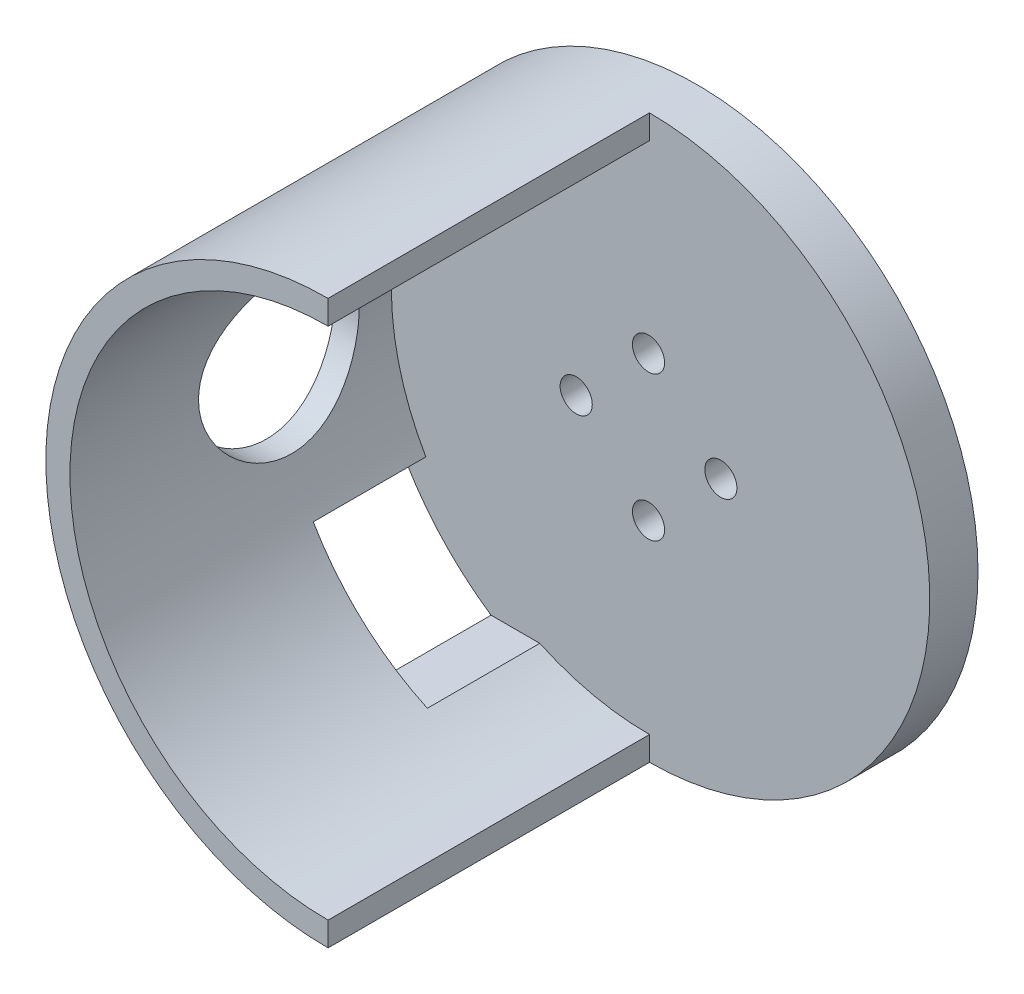
ISO-10303-21;
HEADER;
FILE_DESCRIPTION(('STEP AP214'),'2;1');
FILE_NAME('part.step','',(''),(''),'','','');
FILE_SCHEMA(('AUTOMOTIVE_DESIGN { 1 0 10303 214 1 1 1 1 }'));
ENDSEC;
DATA;
#1=APPLICATION_CONTEXT('core data for automotive mechanical design processes');
#2=APPLICATION_PROTOCOL_DEFINITION('international standard','automotive_design',2000,#1);
#3=PRODUCT_CONTEXT('',#1,'mechanical');
#4=PRODUCT('Part','Part','',(#3));
#5=PRODUCT_RELATED_PRODUCT_CATEGORY('part','',(#4));
#6=PRODUCT_DEFINITION_FORMATION('','',#4);
#7=PRODUCT_DEFINITION_CONTEXT('part definition',#1,'design');
#8=PRODUCT_DEFINITION('design','',#6,#7);
#9=PRODUCT_DEFINITION_SHAPE('','',#8);
#10=(LENGTH_UNIT() NAMED_UNIT(*) SI_UNIT(.MILLI.,.METRE.));
#11=(NAMED_UNIT(*) PLANE_ANGLE_UNIT() SI_UNIT($,.RADIAN.));
#12=(NAMED_UNIT(*) SI_UNIT($,.STERADIAN.) SOLID_ANGLE_UNIT());
#13=UNCERTAINTY_MEASURE_WITH_UNIT(LENGTH_MEASURE(1.E-05),#10,'distance_accuracy_value','');
#14=(GEOMETRIC_REPRESENTATION_CONTEXT(3) GLOBAL_UNCERTAINTY_ASSIGNED_CONTEXT((#13)) GLOBAL_UNIT_ASSIGNED_CONTEXT((#10,
#11,#12)) REPRESENTATION_CONTEXT('',''));
#15=CARTESIAN_POINT('',(0.,0.,0.));
#16=DIRECTION('',(0.,0.,1.));
#17=DIRECTION('',(1.,0.,0.));
#18=AXIS2_PLACEMENT_3D('',#15,#16,#17);
#19=CARTESIAN_POINT('',(0.,0.,20.));
#20=DIRECTION('',(0.,0.,1.));
#21=DIRECTION('',(1.,0.,0.));
#22=AXIS2_PLACEMENT_3D('',#19,#20,#21);
#23=PLANE('',#22);
#24=CARTESIAN_POINT('',(0.,0.,20.));
#25=DIRECTION('',(0.,0.,1.));
#26=DIRECTION('',(1.,0.,0.));
#27=AXIS2_PLACEMENT_3D('',#24,#25,#26);
#28=CIRCLE('',#27,17.5);
#29=CARTESIAN_POINT('',(0.0613389301193247,17.4998925006885,20.));
#30=VERTEX_POINT('',#29);
#31=CARTESIAN_POINT('',(0.0613389301193247,-17.4998925006885,20.));
#32=VERTEX_POINT('',#31);
#33=EDGE_CURVE('E51',#30,#32,#28,.T.);
#34=ORIENTED_EDGE('',*,*,#33,.T.);
#35=DIRECTION('',(0.,1.,0.));
#36=VECTOR('',#35,1.);
#37=CARTESIAN_POINT('',(0.0613389301193247,0.,20.));
#38=LINE('',#37,#36);
#39=CARTESIAN_POINT('',(0.0613389301193247,-15.9998824225571,20.));
#40=VERTEX_POINT('',#39);
#41=EDGE_CURVE('E159',#32,#40,#38,.T.);
#42=ORIENTED_EDGE('',*,*,#41,.T.);
#43=CARTESIAN_POINT('',(0.,0.,20.));
#44=DIRECTION('',(0.,0.,1.));
#45=DIRECTION('',(1.,0.,0.));
#46=AXIS2_PLACEMENT_3D('',#43,#44,#45);
#47=CIRCLE('',#46,16.);
#48=CARTESIAN_POINT('',(0.0613389301193247,15.9998824225571,20.));
#49=VERTEX_POINT('',#48);
#50=EDGE_CURVE('E242',#49,#40,#47,.T.);
#51=ORIENTED_EDGE('',*,*,#50,.F.);
#52=EDGE_CURVE('E154',#49,#30,#38,.T.);
#53=ORIENTED_EDGE('',*,*,#52,.T.);
#54=EDGE_LOOP('',(#34,#42,#51,#53));
#55=FACE_BOUND('',#54,.T.);
#56=ADVANCED_FACE('F41',(#55),#23,.T.);
#57=CARTESIAN_POINT('',(0.,0.,20.));
#58=DIRECTION('',(0.,0.,-1.));
#59=DIRECTION('',(-1.,0.,0.));
#60=AXIS2_PLACEMENT_3D('',#57,#58,#59);
#61=CYLINDRICAL_SURFACE('',#60,17.5);
#62=DIRECTION('',(0.,0.,-1.));
#63=VECTOR('',#62,1.);
#64=CARTESIAN_POINT('',(-9.79795897113271,-14.5,20.));
#65=LINE('',#64,#63);
#66=CARTESIAN_POINT('',(-9.79795897113271,-14.5,7.));
#67=VERTEX_POINT('',#66);
#68=CARTESIAN_POINT('',(-9.79795897113271,-14.5,0.));
#69=VERTEX_POINT('',#68);
#70=EDGE_CURVE('E126',#67,#69,#65,.T.);
#71=ORIENTED_EDGE('',*,*,#70,.T.);
#72=CARTESIAN_POINT('',(0.,0.,0.));
#73=DIRECTION('',(0.,0.,-1.));
#74=DIRECTION('',(0.,1.,0.));
#75=AXIS2_PLACEMENT_3D('',#72,#73,#74);
#76=CIRCLE('',#75,17.5);
#77=CARTESIAN_POINT('',(-15.5643824162734,-8.,0.));
#78=VERTEX_POINT('',#77);
#79=EDGE_CURVE('E118',#69,#78,#76,.T.);
#80=ORIENTED_EDGE('',*,*,#79,.T.);
#81=DIRECTION('',(0.,0.,-1.));
#82=VECTOR('',#81,1.);
#83=CARTESIAN_POINT('',(-15.5643824162734,-8.,20.));
#84=LINE('',#83,#82);
#85=CARTESIAN_POINT('',(-15.5643824162734,-8.,7.));
#86=VERTEX_POINT('',#85);
#87=EDGE_CURVE('E104',#78,#86,#84,.F.);
#88=ORIENTED_EDGE('',*,*,#87,.T.);
#89=CARTESIAN_POINT('',(0.,0.,7.));
#90=DIRECTION('',(0.,0.,1.));
#91=DIRECTION('',(0.,-1.,0.));
#92=AXIS2_PLACEMENT_3D('',#89,#90,#91);
#93=CIRCLE('',#92,17.5);
#94=EDGE_CURVE('E129',#86,#67,#93,.T.);
#95=ORIENTED_EDGE('',*,*,#94,.T.);
#96=EDGE_LOOP('',(#71,#80,#88,#95));
#97=FACE_BOUND('',#96,.T.);
#98=CARTESIAN_POINT('',(0.,0.,-3.));
#99=DIRECTION('',(0.,0.,1.));
#100=DIRECTION('',(1.,0.,0.));
#101=AXIS2_PLACEMENT_3D('',#98,#99,#100);
#102=CIRCLE('',#101,17.5);
#103=CARTESIAN_POINT('',(17.5,0.,-3.));
#104=VERTEX_POINT('',#103);
#105=EDGE_CURVE('E204',#104,#104,#102,.T.);
#106=ORIENTED_EDGE('',*,*,#105,.T.);
#107=EDGE_LOOP('',(#106));
#108=FACE_BOUND('',#107,.T.);
#109=CARTESIAN_POINT('',(-17.5,0.,12.));
#110=CARTESIAN_POINT('',(-17.4999967323586,-0.274887255943128,11.9999951510951));
#111=CARTESIAN_POINT('',(-17.4934604350511,-0.549824369681454,11.9772555275597));
#112=CARTESIAN_POINT('',(-17.4680226486276,-1.09172997799247,11.8870893247442));
#113=CARTESIAN_POINT('',(-17.4491164802521,-1.35869541707404,11.8196458348148));
#114=CARTESIAN_POINT('',(-17.4010172837268,-1.87676075184468,11.6424799039587));
#115=CARTESIAN_POINT('',(-17.3718386026585,-2.12788220212056,11.5328164096201));
#116=CARTESIAN_POINT('',(-17.3062494579136,-2.60817190282318,11.2745550213041));
#117=CARTESIAN_POINT('',(-17.2698382377007,-2.83733785294541,11.1259530537741));
#118=CARTESIAN_POINT('',(-17.1926183656394,-3.27323611714736,10.7899124733177));
#119=CARTESIAN_POINT('',(-17.1517260486293,-3.47930930595233,10.6016381153618));
#120=CARTESIAN_POINT('',(-17.0706683728915,-3.85742839481088,10.1933806421558));
#121=CARTESIAN_POINT('',(-17.0305031239854,-4.02946919269461,9.97339278091952));
#122=CARTESIAN_POINT('',(-16.9545753718829,-4.3379947501607,9.50251604302262));
#123=CARTESIAN_POINT('',(-16.9189175626436,-4.47369552758351,9.25109503733746));
#124=CARTESIAN_POINT('',(-16.8572835960235,-4.7006292638497,8.72781997062347));
#125=CARTESIAN_POINT('',(-16.8313053561473,-4.79187178889368,8.4559703198242));
#126=CARTESIAN_POINT('',(-16.7928402048755,-4.92496082534618,7.90691309208477));
#127=CARTESIAN_POINT('',(-16.7800244641586,-4.9680138300687,7.63002159307529));
#128=CARTESIAN_POINT('',(-16.7683552051415,-5.00726669473215,7.07267212888988));
#129=CARTESIAN_POINT('',(-16.769498653032,-5.00347673524998,6.79221495189356));
#130=CARTESIAN_POINT('',(-16.7853258599179,-4.95010336906261,6.24532847133277));
#131=CARTESIAN_POINT('',(-16.7995695662338,-4.90200814317313,5.97873912196361));
#132=CARTESIAN_POINT('',(-16.8392837083571,-4.76378465210904,5.45758195085061));
#133=CARTESIAN_POINT('',(-16.8647551590827,-4.67365258702332,5.20301521818008));
#134=CARTESIAN_POINT('',(-16.9244215882327,-4.45276702845641,4.70938438894628));
#135=CARTESIAN_POINT('',(-16.95872291023,-4.32151377932501,4.47055731900275));
#136=CARTESIAN_POINT('',(-17.0321304219627,-4.02245947919414,4.01780859695957));
#137=CARTESIAN_POINT('',(-17.0712376805236,-3.85465029183281,3.80389250566084));
#138=CARTESIAN_POINT('',(-17.151656266434,-3.47975999182637,3.39856906098605));
#139=CARTESIAN_POINT('',(-17.1929951143159,-3.27143718711355,3.20831381008246));
#140=CARTESIAN_POINT('',(-17.2719061804519,-2.82533070596534,2.86518499089877));
#141=CARTESIAN_POINT('',(-17.3094782034438,-2.58754550370467,2.71231335989559));
#142=CARTESIAN_POINT('',(-17.3769132016394,-2.08730768272867,2.44767816306506));
#143=CARTESIAN_POINT('',(-17.4067318874312,-1.82472454452503,2.33614928298958));
#144=CARTESIAN_POINT('',(-17.4549812871891,-1.28348307491866,2.15916527145791));
#145=CARTESIAN_POINT('',(-17.4734148714063,-1.00482881452536,2.09369852688682));
#146=CARTESIAN_POINT('',(-17.4963718628669,-0.449165971610882,2.01256678572638));
#147=CARTESIAN_POINT('',(-17.501331821265,-0.172403367151275,1.99533826156744));
#148=CARTESIAN_POINT('',(-17.4980521176773,0.380066317013954,2.00681816575261));
#149=CARTESIAN_POINT('',(-17.4898140395157,0.655773519392766,2.03552108211481));
#150=CARTESIAN_POINT('',(-17.4613481671301,1.19254658357578,2.13677611079064));
#151=CARTESIAN_POINT('',(-17.4413653254419,1.4537955293371,2.20843295330849));
#152=CARTESIAN_POINT('',(-17.3916999685472,1.9605217155141,2.39250125496168));
#153=CARTESIAN_POINT('',(-17.3620163316471,2.20599712812179,2.50491742722334));
#154=CARTESIAN_POINT('',(-17.2952490292284,2.68010421280007,2.77005834161282));
#155=CARTESIAN_POINT('',(-17.2580190794575,2.90825621635021,2.92360299706335));
#156=CARTESIAN_POINT('',(-17.180448677462,3.33609632014868,3.26563126487772));
#157=CARTESIAN_POINT('',(-17.1401075188813,3.53577792710762,3.45412282516136));
#158=CARTESIAN_POINT('',(-17.0592154907323,3.90776607085015,3.86802335512367));
#159=CARTESIAN_POINT('',(-17.0187009214433,4.07896356851775,4.09443818889788));
#160=CARTESIAN_POINT('',(-16.9434723683839,4.38098829016899,4.57365647156141));
#161=CARTESIAN_POINT('',(-16.9087581828186,4.51181691871704,4.82645900192717));
#162=CARTESIAN_POINT('',(-16.8494662810178,4.72843635295665,5.35022802743902));
#163=CARTESIAN_POINT('',(-16.8248350005383,4.8144658309902,5.62108940874769));
#164=CARTESIAN_POINT('',(-16.7885614169356,4.93948625169787,6.17427483893332));
#165=CARTESIAN_POINT('',(-16.7769151780959,4.9784914475439,6.4565953876774));
#166=CARTESIAN_POINT('',(-16.7682925774812,5.00745060616827,7.0132400823757));
#167=CARTESIAN_POINT('',(-16.7707790176036,4.99920069109391,7.28746376148121));
#168=CARTESIAN_POINT('',(-16.7888649275624,4.93811777392153,7.83043682673311));
#169=CARTESIAN_POINT('',(-16.8044639598361,4.88528625949613,8.09918639524222));
#170=CARTESIAN_POINT('',(-16.8466744296963,4.73764922042289,8.6209459278904));
#171=CARTESIAN_POINT('',(-16.8731719264076,4.64327729466074,8.87408846751958));
#172=CARTESIAN_POINT('',(-16.9341825708695,4.41557373253792,9.36114683623883));
#173=CARTESIAN_POINT('',(-16.9686971370099,4.28223520107836,9.59505925318534));
#174=CARTESIAN_POINT('',(-17.0432917237999,3.97516366337116,10.045458804511));
#175=CARTESIAN_POINT('',(-17.0835190794904,3.80023069306842,10.2611034783543));
#176=CARTESIAN_POINT('',(-17.164246127292,3.41714960094825,10.6605597395252));
#177=CARTESIAN_POINT('',(-17.2047458854255,3.20899312682136,10.8443632977772));
#178=CARTESIAN_POINT('',(-17.282698989313,2.75893580216352,11.1795929608164));
#179=CARTESIAN_POINT('',(-17.3200475259364,2.51630625589946,11.330067468174));
#180=CARTESIAN_POINT('',(-17.3862848944483,2.00812632411665,11.5878644625551));
#181=CARTESIAN_POINT('',(-17.4151783467569,1.74258856028685,11.6952105298327));
#182=CARTESIAN_POINT('',(-17.4581836181329,1.23229078833759,11.8521188784886));
#183=CARTESIAN_POINT('',(-17.473742109052,0.989407519060976,11.9074338417114));
#184=CARTESIAN_POINT('',(-17.4946510963036,0.497695921965917,11.9813741431054));
#185=CARTESIAN_POINT('',(-17.5000029583499,0.248868394040229,12.0000043899422));
#186=CARTESIAN_POINT('',(-17.5,0.,12.));
#187=B_SPLINE_CURVE_WITH_KNOTS('',3,(#109,#110,#111,#112,#113,#114,#115,#116,#117,#118,#119,
#120,#121,#122,#123,#124,#125,#126,#127,#128,#129,#130,#131,#132,#133,#134,#135,#136,#137,#138,
#139,#140,#141,#142,#143,#144,#145,#146,#147,#148,#149,#150,#151,#152,#153,#154,#155,#156,#157,
#158,#159,#160,#161,#162,#163,#164,#165,#166,#167,#168,#169,#170,#171,#172,#173,#174,#175,#176,
#177,#178,#179,#180,#181,#182,#183,#184,#185,#186),.UNSPECIFIED.,.T.,.F.,(4,2,2,2,2,2,2,2,2,2,2,
2,2,2,2,2,2,2,2,2,2,2,2,2,2,2,2,2,2,2,2,2,2,2,2,2,2,2,4),(0.,0.82374828135586,1.64780834948795,
2.47072203223836,3.29372183858789,4.13619528826953,4.97879494684283,5.83832688250143,
6.69767378862023,7.53498774656874,8.37211973078082,9.18211964575844,9.99219279470076,
10.8125200823279,11.6330301394812,12.4844625151101,13.3359390039338,14.1921775276588,
15.0482001004129,15.8761364425026,16.7039734359138,17.5151285120356,18.3263774144358,
19.1551881336589,19.9841875797423,20.840302622156,21.6963878741801,22.5478643342011,
23.399082644741,24.2181670405214,25.0372241048183,25.8479274074504,26.6587742501082,
27.4966914224279,28.3348195778806,29.1944494744229,30.053608731021,30.7994867011175,
31.5452648608618),.UNSPECIFIED.);
#188=CARTESIAN_POINT('',(-17.5,0.,12.));
#189=VERTEX_POINT('',#188);
#190=EDGE_CURVE('E196',#189,#189,#187,.T.);
#191=ORIENTED_EDGE('',*,*,#190,.T.);
#192=EDGE_LOOP('',(#191));
#193=FACE_BOUND('',#192,.T.);
#194=DIRECTION('',(0.,0.,-1.));
#195=VECTOR('',#194,1.);
#196=CARTESIAN_POINT('',(0.0613389301193247,-17.4998925006885,30.));
#197=LINE('',#196,#195);
#198=CARTESIAN_POINT('',(0.0613389301193247,-17.4998925006885,0.));
#199=VERTEX_POINT('',#198);
#200=EDGE_CURVE('E144',#32,#199,#197,.T.);
#201=ORIENTED_EDGE('',*,*,#200,.F.);
#202=ORIENTED_EDGE('',*,*,#33,.F.);
#203=DIRECTION('',(0.,0.,-1.));
#204=VECTOR('',#203,1.);
#205=CARTESIAN_POINT('',(0.0613389301193247,17.4998925006885,30.));
#206=LINE('',#205,#204);
#207=CARTESIAN_POINT('',(0.0613389301193247,17.4998925006885,0.));
#208=VERTEX_POINT('',#207);
#209=EDGE_CURVE('E140',#30,#208,#206,.T.);
#210=ORIENTED_EDGE('',*,*,#209,.T.);
#211=CARTESIAN_POINT('',(0.,0.,0.));
#212=DIRECTION('',(0.,0.,1.));
#213=DIRECTION('',(1.,0.,0.));
#214=AXIS2_PLACEMENT_3D('',#211,#212,#213);
#215=CIRCLE('',#214,17.5);
#216=EDGE_CURVE('E147',#199,#208,#215,.T.);
#217=ORIENTED_EDGE('',*,*,#216,.F.);
#218=EDGE_LOOP('',(#201,#202,#210,#217));
#219=FACE_BOUND('',#218,.T.);
#220=ADVANCED_FACE('F43',(#97,#108,#193,#219),#61,.T.);
#221=CARTESIAN_POINT('',(0.,0.,20.));
#222=DIRECTION('',(0.,0.,-1.));
#223=DIRECTION('',(-1.,0.,0.));
#224=AXIS2_PLACEMENT_3D('',#221,#222,#223);
#225=CYLINDRICAL_SURFACE('',#224,16.);
#226=DIRECTION('',(0.,0.,-1.));
#227=VECTOR('',#226,1.);
#228=CARTESIAN_POINT('',(-6.76387462923433,-14.5,20.));
#229=LINE('',#228,#227);
#230=CARTESIAN_POINT('',(-6.76387462923433,-14.5,7.));
#231=VERTEX_POINT('',#230);
#232=CARTESIAN_POINT('',(-6.76387462923433,-14.5,0.));
#233=VERTEX_POINT('',#232);
#234=EDGE_CURVE('E110',#231,#233,#229,.T.);
#235=ORIENTED_EDGE('',*,*,#234,.F.);
#236=CARTESIAN_POINT('',(0.,0.,7.));
#237=DIRECTION('',(0.,0.,1.));
#238=DIRECTION('',(0.,-1.,0.));
#239=AXIS2_PLACEMENT_3D('',#236,#237,#238);
#240=CIRCLE('',#239,16.);
#241=CARTESIAN_POINT('',(-13.856406460551,-8.,7.));
#242=VERTEX_POINT('',#241);
#243=EDGE_CURVE('E11',#242,#231,#240,.T.);
#244=ORIENTED_EDGE('',*,*,#243,.F.);
#245=DIRECTION('',(0.,0.,-1.));
#246=VECTOR('',#245,1.);
#247=CARTESIAN_POINT('',(-13.856406460551,-8.,20.));
#248=LINE('',#247,#246);
#249=CARTESIAN_POINT('',(-13.856406460551,-8.,0.));
#250=VERTEX_POINT('',#249);
#251=EDGE_CURVE('E111',#250,#242,#248,.F.);
#252=ORIENTED_EDGE('',*,*,#251,.F.);
#253=CARTESIAN_POINT('',(0.,0.,0.));
#254=DIRECTION('',(0.,0.,1.));
#255=DIRECTION('',(1.,0.,0.));
#256=AXIS2_PLACEMENT_3D('',#253,#254,#255);
#257=CIRCLE('',#256,16.);
#258=CARTESIAN_POINT('',(0.0613389301193247,15.9998824225571,0.));
#259=VERTEX_POINT('',#258);
#260=EDGE_CURVE('E121',#259,#250,#257,.T.);
#261=ORIENTED_EDGE('',*,*,#260,.F.);
#262=DIRECTION('',(0.,0.,-1.));
#263=VECTOR('',#262,1.);
#264=CARTESIAN_POINT('',(0.0613389301193247,15.9998824225571,20.));
#265=LINE('',#264,#263);
#266=EDGE_CURVE('E150',#259,#49,#265,.F.);
#267=ORIENTED_EDGE('',*,*,#266,.T.);
#268=ORIENTED_EDGE('',*,*,#50,.T.);
#269=DIRECTION('',(0.,0.,-1.));
#270=VECTOR('',#269,1.);
#271=CARTESIAN_POINT('',(0.0613389301193247,-15.9998824225571,20.));
#272=LINE('',#271,#270);
#273=CARTESIAN_POINT('',(0.0613389301193247,-15.9998824225571,0.));
#274=VERTEX_POINT('',#273);
#275=EDGE_CURVE('E158',#40,#274,#272,.T.);
#276=ORIENTED_EDGE('',*,*,#275,.T.);
#277=EDGE_CURVE('E245',#233,#274,#257,.T.);
#278=ORIENTED_EDGE('',*,*,#277,.F.);
#279=EDGE_LOOP('',(#235,#244,#252,#261,#267,#268,#276,#278));
#280=FACE_BOUND('',#279,.T.);
#281=CARTESIAN_POINT('',(-16.,0.,12.));
#282=CARTESIAN_POINT('',(-15.9999986351195,-0.273756740698179,11.9999982136497));
#283=CARTESIAN_POINT('',(-15.9929077993933,-0.54753221001141,11.9774430922222));
#284=CARTESIAN_POINT('',(-15.9653157635526,-1.08707683835382,11.888055033843));
#285=CARTESIAN_POINT('',(-15.9448115279957,-1.35284417090373,11.8212120745424));
#286=CARTESIAN_POINT('',(-15.892632627915,-1.86851417460312,11.6457225152172));
#287=CARTESIAN_POINT('',(-15.860975259956,-2.11844070794284,11.5371406213887));
#288=CARTESIAN_POINT('',(-15.7897587664487,-2.59653920938621,11.2815307292862));
#289=CARTESIAN_POINT('',(-15.7501983960149,-2.82470774178094,11.1344966728757));
#290=CARTESIAN_POINT('',(-15.6660085495921,-3.25986133980768,10.8013760319326));
#291=CARTESIAN_POINT('',(-15.621268637007,-3.46608011262119,10.6143164597633));
#292=CARTESIAN_POINT('',(-15.5324018550409,-3.84478952815342,10.2085264303382));
#293=CARTESIAN_POINT('',(-15.4882751012093,-4.01727389161514,9.98979008999343));
#294=CARTESIAN_POINT('',(-15.4044457876484,-4.32777345930637,9.52022174479268));
#295=CARTESIAN_POINT('',(-15.3648795310221,-4.46483136593109,9.2687300899923));
#296=CARTESIAN_POINT('',(-15.2963120709366,-4.69438964299238,8.74483074017737));
#297=CARTESIAN_POINT('',(-15.2673080849026,-4.78690175085853,8.47242857685659));
#298=CARTESIAN_POINT('',(-15.224304279618,-4.92193839721856,7.92308769016631));
#299=CARTESIAN_POINT('',(-15.2098789171452,-4.96588440031618,7.64653262543181));
#300=CARTESIAN_POINT('',(-15.1964022056731,-5.00698220147793,7.0896275243652));
#301=CARTESIAN_POINT('',(-15.1973467694717,-5.00414643984172,6.80927851673902));
#302=CARTESIAN_POINT('',(-15.2141275626545,-4.95287298929817,6.26450215888892));
#303=CARTESIAN_POINT('',(-15.2293736684469,-4.90624231472934,5.99988349644806));
#304=CARTESIAN_POINT('',(-15.272081024701,-4.77163253417961,5.48243137375097));
#305=CARTESIAN_POINT('',(-15.2995435733467,-4.68364903377187,5.2295991691417));
#306=CARTESIAN_POINT('',(-15.3640417609541,-4.46755498726522,4.73859222230161));
#307=CARTESIAN_POINT('',(-15.4012113865356,-4.33887702648707,4.5006855572407));
#308=CARTESIAN_POINT('',(-15.4808742631002,-4.04544082951013,4.04924892847488));
#309=CARTESIAN_POINT('',(-15.523368895754,-3.88067322086205,3.83572531898279));
#310=CARTESIAN_POINT('',(-15.6112611120491,-3.51086781672958,3.42890022633452));
#311=CARTESIAN_POINT('',(-15.6567027842357,-3.30433828237156,3.23696176888193));
#312=CARTESIAN_POINT('',(-15.7436628303753,-2.86145763238183,2.89011242568063));
#313=CARTESIAN_POINT('',(-15.7851809135328,-2.62510430939601,2.73520428312299));
#314=CARTESIAN_POINT('',(-15.8600517956098,-2.1266584418619,2.46588924559508));
#315=CARTESIAN_POINT('',(-15.8933384259289,-1.86437962767714,2.35180745814418));
#316=CARTESIAN_POINT('',(-15.9475182331416,-1.32307191113056,2.16978799659369));
#317=CARTESIAN_POINT('',(-15.9684151730059,-1.04404812289843,2.10183631104641));
#318=CARTESIAN_POINT('',(-15.9948555758007,-0.488740629161386,2.0163278296841));
#319=CARTESIAN_POINT('',(-16.0009609158175,-0.212767395155375,1.99692582562591));
#320=CARTESIAN_POINT('',(-15.9987919892393,0.338521222930343,2.00386490654933));
#321=CARTESIAN_POINT('',(-15.9905198232454,0.613836697226034,2.03019930929045));
#322=CARTESIAN_POINT('',(-15.9608945507905,1.14887733190339,2.12638237042555));
#323=CARTESIAN_POINT('',(-15.9398717244275,1.40881991368375,2.19513307044995));
#324=CARTESIAN_POINT('',(-15.8872048551716,1.91340771544551,2.37285740946687));
#325=CARTESIAN_POINT('',(-15.8555595005737,2.15805104179623,2.48183601610005));
#326=CARTESIAN_POINT('',(-15.783941710377,2.63172962668875,2.73989286619475));
#327=CARTESIAN_POINT('',(-15.7437850727067,2.86023895915116,2.88988394998725));
#328=CARTESIAN_POINT('',(-15.6597364001372,3.28946340384104,3.2246128404697));
#329=CARTESIAN_POINT('',(-15.6158433539155,3.4901709521758,3.40936007097857));
#330=CARTESIAN_POINT('',(-15.5270797953257,3.86634985167607,3.8170355602084));
#331=CARTESIAN_POINT('',(-15.4822394682577,4.04050609358125,4.0411866549569));
#332=CARTESIAN_POINT('',(-15.3984778838242,4.34885000980606,4.5165064655071));
#333=CARTESIAN_POINT('',(-15.3595565324524,4.48303831893718,4.76767475210794));
#334=CARTESIAN_POINT('',(-15.2924712932348,4.70680333922169,5.28938069148191));
#335=CARTESIAN_POINT('',(-15.264265854275,4.7965527822405,5.55983859774289));
#336=CARTESIAN_POINT('',(-15.2220468337724,4.9289157727236,6.11308997299448));
#337=CARTESIAN_POINT('',(-15.2080278520491,4.97154725655978,6.39587870537413));
#338=CARTESIAN_POINT('',(-15.1963317085551,5.00717624632502,6.95201635032171));
#339=CARTESIAN_POINT('',(-15.1979441840057,5.00233118486543,7.22521381538967));
#340=CARTESIAN_POINT('',(-15.2156036150361,4.94835272515335,7.76669833976775));
#341=CARTESIAN_POINT('',(-15.2316498972642,4.89922139290048,8.03498562754694));
#342=CARTESIAN_POINT('',(-15.2758725673356,4.7595091965447,8.55517615836757));
#343=CARTESIAN_POINT('',(-15.3038679276103,4.66954569624033,8.80726176437344));
#344=CARTESIAN_POINT('',(-15.3687881701826,4.45120909339998,9.29296165413602));
#345=CARTESIAN_POINT('',(-15.4057148685869,4.32282817776947,9.52657216831362));
#346=CARTESIAN_POINT('',(-15.4861394813401,4.02542700053973,9.97858388175925));
#347=CARTESIAN_POINT('',(-15.5298379569183,3.85501334096529,10.196032518001));
#348=CARTESIAN_POINT('',(-15.6179599528484,3.4808359856192,10.599945312448));
#349=CARTESIAN_POINT('',(-15.6623836642662,3.27706336937756,10.7864011559642));
#350=CARTESIAN_POINT('',(-15.7486908780989,2.83394665129338,11.1291301534517));
#351=CARTESIAN_POINT('',(-15.7904440692269,2.59365829794953,11.2842189457998));
#352=CARTESIAN_POINT('',(-15.8650707718751,2.0891165520546,11.5515956605578));
#353=CARTESIAN_POINT('',(-15.8979477726329,1.82487263118179,11.6639004085673));
#354=CARTESIAN_POINT('',(-15.9488260293388,1.30299054149591,11.8343654704339));
#355=CARTESIAN_POINT('',(-15.9678496322456,1.04668134845019,11.8962994692214));
#356=CARTESIAN_POINT('',(-15.9934360136194,0.526919581760988,11.9791134398709));
#357=CARTESIAN_POINT('',(-16.0000013135858,0.263468464558692,12.000001719216));
#358=CARTESIAN_POINT('',(-16.,0.,12.));
#359=B_SPLINE_CURVE_WITH_KNOTS('',3,(#281,#282,#283,#284,#285,#286,#287,#288,#289,#290,#291,
#292,#293,#294,#295,#296,#297,#298,#299,#300,#301,#302,#303,#304,#305,#306,#307,#308,#309,#310,
#311,#312,#313,#314,#315,#316,#317,#318,#319,#320,#321,#322,#323,#324,#325,#326,#327,#328,#329,
#330,#331,#332,#333,#334,#335,#336,#337,#338,#339,#340,#341,#342,#343,#344,#345,#346,#347,#348,
#349,#350,#351,#352,#353,#354,#355,#356,#357,#358),.UNSPECIFIED.,.T.,.F.,(4,2,2,2,2,2,2,2,2,2,2,
2,2,2,2,2,2,2,2,2,2,2,2,2,2,2,2,2,2,2,2,2,2,2,2,2,2,2,4),(0.,0.820301797730039,1.64078929339626,
2.46000991680974,3.27935968623356,4.12151288780633,4.96382269725105,5.82695084991452,
6.68985145121463,7.52676600672195,8.36345801183908,9.16707669695194,9.97078079925601,
10.7862257089153,11.6018826405078,12.4546698912775,13.3075202966256,14.1670184276843,
15.0262553798756,15.852302742023,16.678229426068,17.4836250690084,18.2891202014735,
19.1142529896272,19.9396098284639,20.7976711486191,21.655718839442,22.5104046302277,
23.3647649559871,24.1804881394266,24.9961732705188,25.7999165363422,26.6038233736823,
27.4391805607299,28.274761495409,29.1376267255319,30.0001522671289,30.789785466537,
31.5792588309973),.UNSPECIFIED.);
#360=CARTESIAN_POINT('',(-16.,0.,12.));
#361=VERTEX_POINT('',#360);
#362=EDGE_CURVE('E195',#361,#361,#359,.T.);
#363=ORIENTED_EDGE('',*,*,#362,.F.);
#364=EDGE_LOOP('',(#363));
#365=FACE_BOUND('',#364,.T.);
#366=ADVANCED_FACE('F225',(#280,#365),#225,.F.);
#367=CARTESIAN_POINT('',(0.,0.,0.));
#368=DIRECTION('',(0.,0.,1.));
#369=DIRECTION('',(1.,0.,0.));
#370=AXIS2_PLACEMENT_3D('',#367,#368,#369);
#371=PLANE('',#370);
#372=ORIENTED_EDGE('',*,*,#260,.T.);
#373=DIRECTION('',(1.,0.,0.));
#374=VECTOR('',#373,1.);
#375=CARTESIAN_POINT('',(-30.,-8.,0.));
#376=LINE('',#375,#374);
#377=EDGE_CURVE('E63',#78,#250,#376,.T.);
#378=ORIENTED_EDGE('',*,*,#377,.F.);
#379=ORIENTED_EDGE('',*,*,#79,.F.);
#380=DIRECTION('',(1.,0.,0.));
#381=VECTOR('',#380,1.);
#382=CARTESIAN_POINT('',(-30.,-14.5,0.));
#383=LINE('',#382,#381);
#384=EDGE_CURVE('E317',#69,#233,#383,.T.);
#385=ORIENTED_EDGE('',*,*,#384,.T.);
#386=ORIENTED_EDGE('',*,*,#277,.T.);
#387=DIRECTION('',(0.,-1.,0.));
#388=VECTOR('',#387,1.);
#389=CARTESIAN_POINT('',(0.0613389301193247,-17.4998925006885,0.));
#390=LINE('',#389,#388);
#391=EDGE_CURVE('E128',#274,#199,#390,.T.);
#392=ORIENTED_EDGE('',*,*,#391,.T.);
#393=ORIENTED_EDGE('',*,*,#216,.T.);
#394=EDGE_CURVE('E134',#208,#259,#390,.T.);
#395=ORIENTED_EDGE('',*,*,#394,.T.);
#396=EDGE_LOOP('',(#372,#378,#379,#385,#386,#392,#393,#395));
#397=FACE_BOUND('',#396,.T.);
#398=CARTESIAN_POINT('',(0.,-4.5,0.));
#399=DIRECTION('',(0.,0.,1.));
#400=DIRECTION('',(1.,0.,0.));
#401=AXIS2_PLACEMENT_3D('',#398,#399,#400);
#402=CIRCLE('',#401,1.);
#403=CARTESIAN_POINT('',(1.00000000000005,-4.5,0.));
#404=VERTEX_POINT('',#403);
#405=EDGE_CURVE('E167',#404,#404,#402,.T.);
#406=ORIENTED_EDGE('',*,*,#405,.F.);
#407=EDGE_LOOP('',(#406));
#408=FACE_BOUND('',#407,.T.);
#409=CARTESIAN_POINT('',(0.,4.5,0.));
#410=DIRECTION('',(0.,0.,1.));
#411=DIRECTION('',(1.,0.,0.));
#412=AXIS2_PLACEMENT_3D('',#409,#410,#411);
#413=CIRCLE('',#412,1.);
#414=CARTESIAN_POINT('',(0.999999999999985,4.5,0.));
#415=VERTEX_POINT('',#414);
#416=EDGE_CURVE('E187',#415,#415,#413,.T.);
#417=ORIENTED_EDGE('',*,*,#416,.F.);
#418=EDGE_LOOP('',(#417));
#419=FACE_BOUND('',#418,.T.);
#420=CARTESIAN_POINT('',(4.5,0.,0.));
#421=DIRECTION('',(0.,0.,1.));
#422=DIRECTION('',(1.,0.,0.));
#423=AXIS2_PLACEMENT_3D('',#420,#421,#422);
#424=CIRCLE('',#423,1.);
#425=CARTESIAN_POINT('',(5.5,0.,0.));
#426=VERTEX_POINT('',#425);
#427=EDGE_CURVE('E191',#426,#426,#424,.T.);
#428=ORIENTED_EDGE('',*,*,#427,.F.);
#429=EDGE_LOOP('',(#428));
#430=FACE_BOUND('',#429,.T.);
#431=CARTESIAN_POINT('',(-4.5,0.,0.));
#432=DIRECTION('',(0.,0.,1.));
#433=DIRECTION('',(1.,0.,0.));
#434=AXIS2_PLACEMENT_3D('',#431,#432,#433);
#435=CIRCLE('',#434,1.);
#436=CARTESIAN_POINT('',(-3.5,0.,0.));
#437=VERTEX_POINT('',#436);
#438=EDGE_CURVE('E183',#437,#437,#435,.T.);
#439=ORIENTED_EDGE('',*,*,#438,.F.);
#440=EDGE_LOOP('',(#439));
#441=FACE_BOUND('',#440,.T.);
#442=ADVANCED_FACE('F115',(#397,#408,#419,#430,#441),#371,.T.);
#443=CARTESIAN_POINT('',(0.,0.,-3.));
#444=DIRECTION('',(0.,0.,1.));
#445=DIRECTION('',(1.,0.,0.));
#446=AXIS2_PLACEMENT_3D('',#443,#444,#445);
#447=PLANE('',#446);
#448=CARTESIAN_POINT('',(4.5,0.,-3.));
#449=DIRECTION('',(0.,0.,-1.));
#450=DIRECTION('',(-1.,0.,0.));
#451=AXIS2_PLACEMENT_3D('',#448,#449,#450);
#452=CIRCLE('',#451,1.);
#453=CARTESIAN_POINT('',(3.5,0.,-3.));
#454=VERTEX_POINT('',#453);
#455=EDGE_CURVE('E163',#454,#454,#452,.T.);
#456=ORIENTED_EDGE('',*,*,#455,.F.);
#457=EDGE_LOOP('',(#456));
#458=FACE_BOUND('',#457,.T.);
#459=CARTESIAN_POINT('',(0.,4.5,-3.));
#460=DIRECTION('',(0.,0.,-1.));
#461=DIRECTION('',(-1.,0.,0.));
#462=AXIS2_PLACEMENT_3D('',#459,#460,#461);
#463=CIRCLE('',#462,1.);
#464=CARTESIAN_POINT('',(-1.00000000000002,4.5,-3.));
#465=VERTEX_POINT('',#464);
#466=EDGE_CURVE('E168',#465,#465,#463,.T.);
#467=ORIENTED_EDGE('',*,*,#466,.F.);
#468=EDGE_LOOP('',(#467));
#469=FACE_BOUND('',#468,.T.);
#470=CARTESIAN_POINT('',(-4.5,0.,-3.));
#471=DIRECTION('',(0.,0.,-1.));
#472=DIRECTION('',(-1.,0.,0.));
#473=AXIS2_PLACEMENT_3D('',#470,#471,#472);
#474=CIRCLE('',#473,1.);
#475=CARTESIAN_POINT('',(-5.5,0.,-3.));
#476=VERTEX_POINT('',#475);
#477=EDGE_CURVE('E172',#476,#476,#474,.T.);
#478=ORIENTED_EDGE('',*,*,#477,.F.);
#479=EDGE_LOOP('',(#478));
#480=FACE_BOUND('',#479,.T.);
#481=CARTESIAN_POINT('',(0.,-4.5,-3.));
#482=DIRECTION('',(0.,0.,-1.));
#483=DIRECTION('',(-1.,0.,0.));
#484=AXIS2_PLACEMENT_3D('',#481,#482,#483);
#485=CIRCLE('',#484,1.);
#486=CARTESIAN_POINT('',(-0.999999999999954,-4.5,-3.));
#487=VERTEX_POINT('',#486);
#488=EDGE_CURVE('E176',#487,#487,#485,.T.);
#489=ORIENTED_EDGE('',*,*,#488,.F.);
#490=EDGE_LOOP('',(#489));
#491=FACE_BOUND('',#490,.T.);
#492=ORIENTED_EDGE('',*,*,#105,.F.);
#493=EDGE_LOOP('',(#492));
#494=FACE_BOUND('',#493,.T.);
#495=ADVANCED_FACE('F212',(#458,#469,#480,#491,#494),#447,.F.);
#496=CARTESIAN_POINT('',(-40.,0.,7.));
#497=DIRECTION('',(1.,0.,0.));
#498=DIRECTION('',(0.,0.,-1.));
#499=AXIS2_PLACEMENT_3D('',#496,#497,#498);
#500=CYLINDRICAL_SURFACE('',#499,5.);
#501=ORIENTED_EDGE('',*,*,#362,.T.);
#502=EDGE_LOOP('',(#501));
#503=FACE_BOUND('',#502,.T.);
#504=ORIENTED_EDGE('',*,*,#190,.F.);
#505=EDGE_LOOP('',(#504));
#506=FACE_BOUND('',#505,.T.);
#507=ADVANCED_FACE('F206',(#503,#506),#500,.F.);
#508=CARTESIAN_POINT('',(0.,-4.5,7.));
#509=DIRECTION('',(0.,0.,-1.));
#510=DIRECTION('',(-1.,0.,0.));
#511=AXIS2_PLACEMENT_3D('',#508,#509,#510);
#512=CYLINDRICAL_SURFACE('',#511,1.);
#513=ORIENTED_EDGE('',*,*,#405,.T.);
#514=EDGE_LOOP('',(#513));
#515=FACE_BOUND('',#514,.T.);
#516=ORIENTED_EDGE('',*,*,#488,.T.);
#517=EDGE_LOOP('',(#516));
#518=FACE_BOUND('',#517,.T.);
#519=ADVANCED_FACE('F211',(#515,#518),#512,.F.);
#520=CARTESIAN_POINT('',(-4.5,0.,7.));
#521=DIRECTION('',(0.,0.,-1.));
#522=DIRECTION('',(-1.,0.,0.));
#523=AXIS2_PLACEMENT_3D('',#520,#521,#522);
#524=CYLINDRICAL_SURFACE('',#523,1.);
#525=ORIENTED_EDGE('',*,*,#438,.T.);
#526=EDGE_LOOP('',(#525));
#527=FACE_BOUND('',#526,.T.);
#528=ORIENTED_EDGE('',*,*,#477,.T.);
#529=EDGE_LOOP('',(#528));
#530=FACE_BOUND('',#529,.T.);
#531=ADVANCED_FACE('F268',(#527,#530),#524,.F.);
#532=CARTESIAN_POINT('',(0.,4.5,7.));
#533=DIRECTION('',(0.,0.,-1.));
#534=DIRECTION('',(-1.,0.,0.));
#535=AXIS2_PLACEMENT_3D('',#532,#533,#534);
#536=CYLINDRICAL_SURFACE('',#535,1.);
#537=ORIENTED_EDGE('',*,*,#416,.T.);
#538=EDGE_LOOP('',(#537));
#539=FACE_BOUND('',#538,.T.);
#540=ORIENTED_EDGE('',*,*,#466,.T.);
#541=EDGE_LOOP('',(#540));
#542=FACE_BOUND('',#541,.T.);
#543=ADVANCED_FACE('F273',(#539,#542),#536,.F.);
#544=CARTESIAN_POINT('',(4.5,0.,7.));
#545=DIRECTION('',(0.,0.,-1.));
#546=DIRECTION('',(-1.,0.,0.));
#547=AXIS2_PLACEMENT_3D('',#544,#545,#546);
#548=CYLINDRICAL_SURFACE('',#547,1.);
#549=ORIENTED_EDGE('',*,*,#427,.T.);
#550=EDGE_LOOP('',(#549));
#551=FACE_BOUND('',#550,.T.);
#552=ORIENTED_EDGE('',*,*,#455,.T.);
#553=EDGE_LOOP('',(#552));
#554=FACE_BOUND('',#553,.T.);
#555=ADVANCED_FACE('F284',(#551,#554),#548,.F.);
#556=CARTESIAN_POINT('',(0.0613389301193247,-17.4998925006885,30.));
#557=DIRECTION('',(1.,0.,0.));
#558=DIRECTION('',(0.,0.,-1.));
#559=AXIS2_PLACEMENT_3D('',#556,#557,#558);
#560=PLANE('',#559);
#561=ORIENTED_EDGE('',*,*,#200,.T.);
#562=ORIENTED_EDGE('',*,*,#391,.F.);
#563=ORIENTED_EDGE('',*,*,#275,.F.);
#564=ORIENTED_EDGE('',*,*,#41,.F.);
#565=EDGE_LOOP('',(#561,#562,#563,#564));
#566=FACE_BOUND('',#565,.T.);
#567=ADVANCED_FACE('F287',(#566),#560,.T.);
#568=ORIENTED_EDGE('',*,*,#266,.F.);
#569=ORIENTED_EDGE('',*,*,#394,.F.);
#570=ORIENTED_EDGE('',*,*,#209,.F.);
#571=ORIENTED_EDGE('',*,*,#52,.F.);
#572=EDGE_LOOP('',(#568,#569,#570,#571));
#573=FACE_BOUND('',#572,.T.);
#574=ADVANCED_FACE('F293',(#573),#560,.T.);
#575=CARTESIAN_POINT('',(-30.,-8.,7.));
#576=DIRECTION('',(0.,0.,1.));
#577=DIRECTION('',(0.,-1.,0.));
#578=AXIS2_PLACEMENT_3D('',#575,#576,#577);
#579=PLANE('',#578);
#580=DIRECTION('',(1.,0.,0.));
#581=VECTOR('',#580,1.);
#582=CARTESIAN_POINT('',(-30.,-8.,7.));
#583=LINE('',#582,#581);
#584=EDGE_CURVE('E58',#86,#242,#583,.T.);
#585=ORIENTED_EDGE('',*,*,#584,.T.);
#586=ORIENTED_EDGE('',*,*,#243,.T.);
#587=DIRECTION('',(1.,0.,0.));
#588=VECTOR('',#587,1.);
#589=CARTESIAN_POINT('',(-30.,-14.5,7.));
#590=LINE('',#589,#588);
#591=EDGE_CURVE('E314',#67,#231,#590,.T.);
#592=ORIENTED_EDGE('',*,*,#591,.F.);
#593=ORIENTED_EDGE('',*,*,#94,.F.);
#594=EDGE_LOOP('',(#585,#586,#592,#593));
#595=FACE_BOUND('',#594,.T.);
#596=ADVANCED_FACE('F300',(#595),#579,.F.);
#597=CARTESIAN_POINT('',(-30.,-14.5,0.));
#598=DIRECTION('',(0.,-1.,0.));
#599=DIRECTION('',(0.,0.,-1.));
#600=AXIS2_PLACEMENT_3D('',#597,#598,#599);
#601=PLANE('',#600);
#602=ORIENTED_EDGE('',*,*,#591,.T.);
#603=ORIENTED_EDGE('',*,*,#234,.T.);
#604=ORIENTED_EDGE('',*,*,#384,.F.);
#605=ORIENTED_EDGE('',*,*,#70,.F.);
#606=EDGE_LOOP('',(#602,#603,#604,#605));
#607=FACE_BOUND('',#606,.T.);
#608=ADVANCED_FACE('F304',(#607),#601,.F.);
#609=CARTESIAN_POINT('',(-30.,-8.,0.));
#610=DIRECTION('',(0.,1.,0.));
#611=DIRECTION('',(0.,0.,1.));
#612=AXIS2_PLACEMENT_3D('',#609,#610,#611);
#613=PLANE('',#612);
#614=ORIENTED_EDGE('',*,*,#377,.T.);
#615=ORIENTED_EDGE('',*,*,#251,.T.);
#616=ORIENTED_EDGE('',*,*,#584,.F.);
#617=ORIENTED_EDGE('',*,*,#87,.F.);
#618=EDGE_LOOP('',(#614,#615,#616,#617));
#619=FACE_BOUND('',#618,.T.);
#620=ADVANCED_FACE('F105',(#619),#613,.F.);
#621=CLOSED_SHELL('',(#56,#220,#366,#442,#495,#507,#519,#531,#543,#555,#567,#574,#596,#608,#620));
#622=MANIFOLD_SOLID_BREP('B2',#621);
#623=ADVANCED_BREP_SHAPE_REPRESENTATION('',(#18,#622),#14);
#624=SHAPE_DEFINITION_REPRESENTATION(#9,#623);
ENDSEC;
END-ISO-10303-21;
